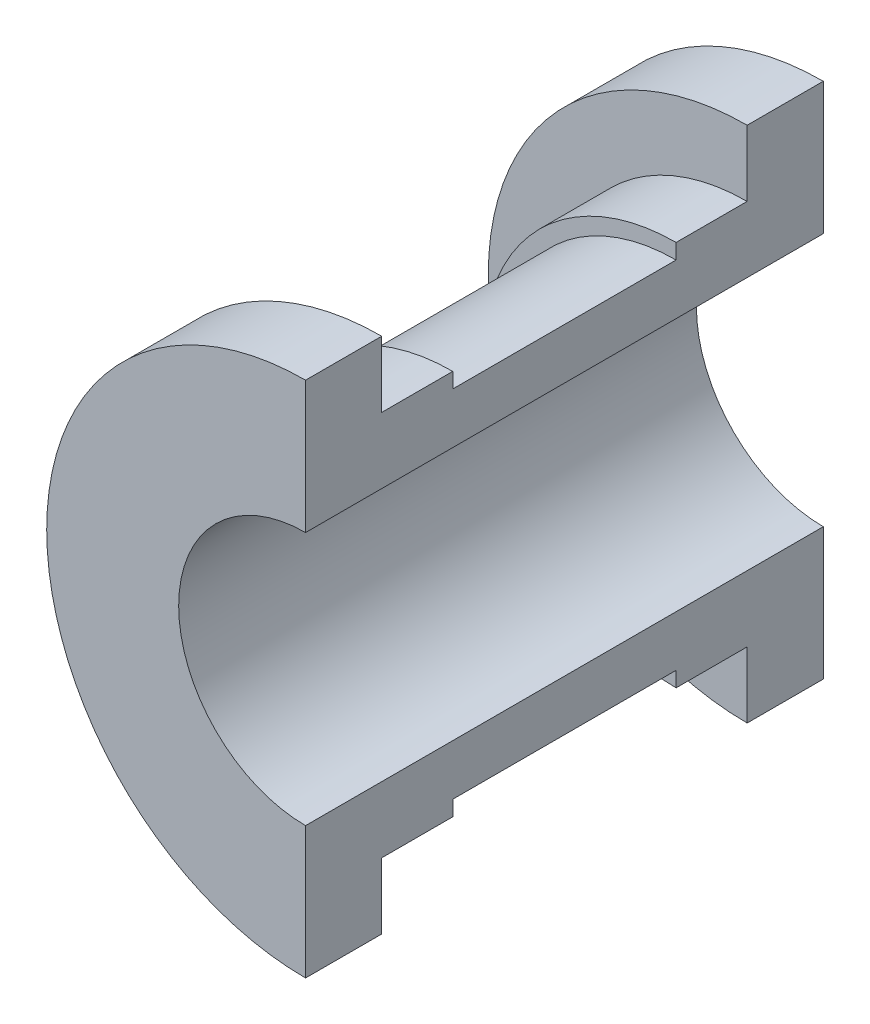
ISO-10303-21;
HEADER;
FILE_DESCRIPTION(('STEP AP214'),'2;1');
FILE_NAME('part.step','',(''),(''),'','','');
FILE_SCHEMA(('AUTOMOTIVE_DESIGN { 1 0 10303 214 1 1 1 1 }'));
ENDSEC;
DATA;
#1=APPLICATION_CONTEXT('core data for automotive mechanical design processes');
#2=APPLICATION_PROTOCOL_DEFINITION('international standard','automotive_design',2000,#1);
#3=PRODUCT_CONTEXT('',#1,'mechanical');
#4=PRODUCT('Part','Part','',(#3));
#5=PRODUCT_RELATED_PRODUCT_CATEGORY('part','',(#4));
#6=PRODUCT_DEFINITION_FORMATION('','',#4);
#7=PRODUCT_DEFINITION_CONTEXT('part definition',#1,'design');
#8=PRODUCT_DEFINITION('design','',#6,#7);
#9=PRODUCT_DEFINITION_SHAPE('','',#8);
#10=(LENGTH_UNIT() NAMED_UNIT(*) SI_UNIT(.MILLI.,.METRE.));
#11=(NAMED_UNIT(*) PLANE_ANGLE_UNIT() SI_UNIT($,.RADIAN.));
#12=(NAMED_UNIT(*) SI_UNIT($,.STERADIAN.) SOLID_ANGLE_UNIT());
#13=UNCERTAINTY_MEASURE_WITH_UNIT(LENGTH_MEASURE(1.E-05),#10,'distance_accuracy_value','');
#14=(GEOMETRIC_REPRESENTATION_CONTEXT(3) GLOBAL_UNCERTAINTY_ASSIGNED_CONTEXT((#13)) GLOBAL_UNIT_ASSIGNED_CONTEXT((#10,
#11,#12)) REPRESENTATION_CONTEXT('',''));
#15=CARTESIAN_POINT('',(0.,0.,0.));
#16=DIRECTION('',(0.,0.,1.));
#17=DIRECTION('',(1.,0.,0.));
#18=AXIS2_PLACEMENT_3D('',#15,#16,#17);
#19=CARTESIAN_POINT('',(-23.5,0.,25.5));
#20=DIRECTION('',(1.,0.,0.));
#21=DIRECTION('',(0.,0.,-1.));
#22=AXIS2_PLACEMENT_3D('',#19,#20,#21);
#23=CYLINDRICAL_SURFACE('',#22,3.);
#24=CARTESIAN_POINT('',(-23.5,0.,25.5));
#25=DIRECTION('',(1.,0.,0.));
#26=DIRECTION('',(0.,0.,-1.));
#27=AXIS2_PLACEMENT_3D('',#24,#25,#26);
#28=CIRCLE('',#27,3.);
#29=CARTESIAN_POINT('',(-23.5,0.,22.5));
#30=VERTEX_POINT('',#29);
#31=EDGE_CURVE('E11',#30,#30,#28,.T.);
#32=ORIENTED_EDGE('',*,*,#31,.T.);
#33=EDGE_LOOP('',(#32));
#34=FACE_BOUND('',#33,.T.);
#35=CARTESIAN_POINT('',(-17.5,0.,25.5));
#36=DIRECTION('',(1.,0.,0.));
#37=DIRECTION('',(0.,0.,-1.));
#38=AXIS2_PLACEMENT_3D('',#35,#36,#37);
#39=CIRCLE('',#38,3.);
#40=CARTESIAN_POINT('',(-17.5,0.,22.5));
#41=VERTEX_POINT('',#40);
#42=EDGE_CURVE('E43',#41,#41,#39,.T.);
#43=ORIENTED_EDGE('',*,*,#42,.F.);
#44=EDGE_LOOP('',(#43));
#45=FACE_BOUND('',#44,.T.);
#46=ADVANCED_FACE('F40',(#34,#45),#23,.T.);
#47=CARTESIAN_POINT('',(-23.5,0.,25.5));
#48=DIRECTION('',(1.,0.,0.));
#49=DIRECTION('',(0.,0.,-1.));
#50=AXIS2_PLACEMENT_3D('',#47,#48,#49);
#51=PLANE('',#50);
#52=ORIENTED_EDGE('',*,*,#31,.F.);
#53=EDGE_LOOP('',(#52));
#54=FACE_BOUND('',#53,.T.);
#55=ADVANCED_FACE('F55',(#54),#51,.F.);
#56=CARTESIAN_POINT('',(-17.5,0.,25.5));
#57=DIRECTION('',(1.,0.,0.));
#58=DIRECTION('',(0.,0.,-1.));
#59=AXIS2_PLACEMENT_3D('',#56,#57,#58);
#60=PLANE('',#59);
#61=ORIENTED_EDGE('',*,*,#42,.T.);
#62=EDGE_LOOP('',(#61));
#63=FACE_BOUND('',#62,.T.);
#64=ADVANCED_FACE('F52',(#63),#60,.T.);
#65=CLOSED_SHELL('',(#46,#55,#64));
#66=MANIFOLD_SOLID_BREP('B2',#65);
#67=CARTESIAN_POINT('',(0.,-25.5,0.));
#68=DIRECTION('',(0.,0.,-1.));
#69=DIRECTION('',(-1.,0.,0.));
#70=AXIS2_PLACEMENT_3D('',#67,#68,#69);
#71=PLANE('',#70);
#72=CARTESIAN_POINT('',(0.,0.,0.));
#73=DIRECTION('',(0.,0.,-1.));
#74=DIRECTION('',(-1.,0.,0.));
#75=AXIS2_PLACEMENT_3D('',#72,#73,#74);
#76=CIRCLE('',#75,12.5);
#77=CARTESIAN_POINT('',(0.,-12.5,0.));
#78=VERTEX_POINT('',#77);
#79=CARTESIAN_POINT('',(0.,12.5,0.));
#80=VERTEX_POINT('',#79);
#81=EDGE_CURVE('E38',#78,#80,#76,.T.);
#82=ORIENTED_EDGE('',*,*,#81,.F.);
#83=DIRECTION('',(0.,-1.,0.));
#84=VECTOR('',#83,1.);
#85=CARTESIAN_POINT('',(0.,-25.5,0.));
#86=LINE('',#85,#84);
#87=CARTESIAN_POINT('',(0.,-25.5,0.));
#88=VERTEX_POINT('',#87);
#89=EDGE_CURVE('E169',#78,#88,#86,.T.);
#90=ORIENTED_EDGE('',*,*,#89,.T.);
#91=CARTESIAN_POINT('',(0.,0.,0.));
#92=DIRECTION('',(0.,0.,-1.));
#93=DIRECTION('',(-1.,0.,0.));
#94=AXIS2_PLACEMENT_3D('',#91,#92,#93);
#95=CIRCLE('',#94,25.5);
#96=CARTESIAN_POINT('',(0.,25.5,0.));
#97=VERTEX_POINT('',#96);
#98=EDGE_CURVE('E164',#88,#97,#95,.T.);
#99=ORIENTED_EDGE('',*,*,#98,.T.);
#100=DIRECTION('',(0.,1.,0.));
#101=VECTOR('',#100,1.);
#102=CARTESIAN_POINT('',(0.,25.5,0.));
#103=LINE('',#102,#101);
#104=EDGE_CURVE('E167',#80,#97,#103,.T.);
#105=ORIENTED_EDGE('',*,*,#104,.F.);
#106=EDGE_LOOP('',(#82,#90,#99,#105));
#107=FACE_BOUND('',#106,.T.);
#108=ADVANCED_FACE('F80',(#107),#71,.T.);
#109=CARTESIAN_POINT('',(0.,0.,-45.6568957060864));
#110=DIRECTION('',(0.,0.,-1.));
#111=DIRECTION('',(-1.,0.,0.));
#112=AXIS2_PLACEMENT_3D('',#109,#110,#111);
#113=CYLINDRICAL_SURFACE('',#112,12.5);
#114=CARTESIAN_POINT('',(0.,0.,51.));
#115=DIRECTION('',(0.,0.,-1.));
#116=DIRECTION('',(-1.,0.,0.));
#117=AXIS2_PLACEMENT_3D('',#114,#115,#116);
#118=CIRCLE('',#117,12.5);
#119=CARTESIAN_POINT('',(0.,-12.5,51.));
#120=VERTEX_POINT('',#119);
#121=CARTESIAN_POINT('',(0.,12.5,51.));
#122=VERTEX_POINT('',#121);
#123=EDGE_CURVE('E88',#120,#122,#118,.T.);
#124=ORIENTED_EDGE('',*,*,#123,.F.);
#125=DIRECTION('',(0.,0.,-1.));
#126=VECTOR('',#125,1.);
#127=CARTESIAN_POINT('',(0.,-12.5,0.));
#128=LINE('',#127,#126);
#129=EDGE_CURVE('E174',#120,#78,#128,.T.);
#130=ORIENTED_EDGE('',*,*,#129,.T.);
#131=ORIENTED_EDGE('',*,*,#81,.T.);
#132=DIRECTION('',(0.,0.,-1.));
#133=VECTOR('',#132,1.);
#134=CARTESIAN_POINT('',(0.,12.5,0.));
#135=LINE('',#134,#133);
#136=EDGE_CURVE('E187',#122,#80,#135,.T.);
#137=ORIENTED_EDGE('',*,*,#136,.F.);
#138=EDGE_LOOP('',(#124,#130,#131,#137));
#139=FACE_BOUND('',#138,.T.);
#140=ADVANCED_FACE('F82',(#139),#113,.F.);
#141=CARTESIAN_POINT('',(0.,-12.5,51.));
#142=DIRECTION('',(0.,0.,1.));
#143=DIRECTION('',(1.,0.,0.));
#144=AXIS2_PLACEMENT_3D('',#141,#142,#143);
#145=PLANE('',#144);
#146=CARTESIAN_POINT('',(0.,0.,51.));
#147=DIRECTION('',(0.,0.,-1.));
#148=DIRECTION('',(-1.,0.,0.));
#149=AXIS2_PLACEMENT_3D('',#146,#147,#148);
#150=CIRCLE('',#149,25.5);
#151=CARTESIAN_POINT('',(0.,-25.5,51.));
#152=VERTEX_POINT('',#151);
#153=CARTESIAN_POINT('',(0.,25.5,51.));
#154=VERTEX_POINT('',#153);
#155=EDGE_CURVE('E260',#152,#154,#150,.T.);
#156=ORIENTED_EDGE('',*,*,#155,.F.);
#157=DIRECTION('',(0.,1.,0.));
#158=VECTOR('',#157,1.);
#159=CARTESIAN_POINT('',(0.,-12.5,51.));
#160=LINE('',#159,#158);
#161=EDGE_CURVE('E242',#152,#120,#160,.T.);
#162=ORIENTED_EDGE('',*,*,#161,.T.);
#163=ORIENTED_EDGE('',*,*,#123,.T.);
#164=DIRECTION('',(0.,-1.,0.));
#165=VECTOR('',#164,1.);
#166=CARTESIAN_POINT('',(0.,12.5,51.));
#167=LINE('',#166,#165);
#168=EDGE_CURVE('E212',#154,#122,#167,.T.);
#169=ORIENTED_EDGE('',*,*,#168,.F.);
#170=EDGE_LOOP('',(#156,#162,#163,#169));
#171=FACE_BOUND('',#170,.T.);
#172=ADVANCED_FACE('F263',(#171),#145,.T.);
#173=CARTESIAN_POINT('',(0.,0.,-45.6568957060864));
#174=DIRECTION('',(0.,0.,-1.));
#175=DIRECTION('',(-1.,0.,0.));
#176=AXIS2_PLACEMENT_3D('',#173,#174,#175);
#177=CYLINDRICAL_SURFACE('',#176,25.5);
#178=CARTESIAN_POINT('',(0.,0.,43.5));
#179=DIRECTION('',(0.,0.,-1.));
#180=DIRECTION('',(-1.,0.,0.));
#181=AXIS2_PLACEMENT_3D('',#178,#179,#180);
#182=CIRCLE('',#181,25.5);
#183=CARTESIAN_POINT('',(0.,-25.5,43.5));
#184=VERTEX_POINT('',#183);
#185=CARTESIAN_POINT('',(0.,25.5,43.5));
#186=VERTEX_POINT('',#185);
#187=EDGE_CURVE('E258',#184,#186,#182,.T.);
#188=ORIENTED_EDGE('',*,*,#187,.F.);
#189=DIRECTION('',(0.,0.,1.));
#190=VECTOR('',#189,1.);
#191=CARTESIAN_POINT('',(0.,-25.5,51.));
#192=LINE('',#191,#190);
#193=EDGE_CURVE('E239',#184,#152,#192,.T.);
#194=ORIENTED_EDGE('',*,*,#193,.T.);
#195=ORIENTED_EDGE('',*,*,#155,.T.);
#196=DIRECTION('',(0.,0.,1.));
#197=VECTOR('',#196,1.);
#198=CARTESIAN_POINT('',(0.,25.5,51.));
#199=LINE('',#198,#197);
#200=EDGE_CURVE('E209',#186,#154,#199,.T.);
#201=ORIENTED_EDGE('',*,*,#200,.F.);
#202=EDGE_LOOP('',(#188,#194,#195,#201));
#203=FACE_BOUND('',#202,.T.);
#204=ADVANCED_FACE('F298',(#203),#177,.T.);
#205=CARTESIAN_POINT('',(0.,-25.5,43.5));
#206=DIRECTION('',(0.,0.,-1.));
#207=DIRECTION('',(-1.,0.,0.));
#208=AXIS2_PLACEMENT_3D('',#205,#206,#207);
#209=PLANE('',#208);
#210=CARTESIAN_POINT('',(0.,0.,43.5));
#211=DIRECTION('',(0.,0.,-1.));
#212=DIRECTION('',(-1.,0.,0.));
#213=AXIS2_PLACEMENT_3D('',#210,#211,#212);
#214=CIRCLE('',#213,19.);
#215=CARTESIAN_POINT('',(0.,-19.,43.5));
#216=VERTEX_POINT('',#215);
#217=CARTESIAN_POINT('',(0.,19.,43.5));
#218=VERTEX_POINT('',#217);
#219=EDGE_CURVE('E256',#216,#218,#214,.T.);
#220=ORIENTED_EDGE('',*,*,#219,.F.);
#221=DIRECTION('',(0.,-1.,0.));
#222=VECTOR('',#221,1.);
#223=CARTESIAN_POINT('',(0.,-25.5,43.5));
#224=LINE('',#223,#222);
#225=EDGE_CURVE('E236',#216,#184,#224,.T.);
#226=ORIENTED_EDGE('',*,*,#225,.T.);
#227=ORIENTED_EDGE('',*,*,#187,.T.);
#228=DIRECTION('',(0.,1.,0.));
#229=VECTOR('',#228,1.);
#230=CARTESIAN_POINT('',(0.,25.5,43.5));
#231=LINE('',#230,#229);
#232=EDGE_CURVE('E206',#218,#186,#231,.T.);
#233=ORIENTED_EDGE('',*,*,#232,.F.);
#234=EDGE_LOOP('',(#220,#226,#227,#233));
#235=FACE_BOUND('',#234,.T.);
#236=ADVANCED_FACE('F295',(#235),#209,.T.);
#237=CARTESIAN_POINT('',(0.,0.,-45.6568957060864));
#238=DIRECTION('',(0.,0.,-1.));
#239=DIRECTION('',(-1.,0.,0.));
#240=AXIS2_PLACEMENT_3D('',#237,#238,#239);
#241=CYLINDRICAL_SURFACE('',#240,19.);
#242=CARTESIAN_POINT('',(0.,0.,36.5));
#243=DIRECTION('',(0.,0.,-1.));
#244=DIRECTION('',(-1.,0.,0.));
#245=AXIS2_PLACEMENT_3D('',#242,#243,#244);
#246=CIRCLE('',#245,19.);
#247=CARTESIAN_POINT('',(0.,-19.,36.5));
#248=VERTEX_POINT('',#247);
#249=CARTESIAN_POINT('',(0.,19.,36.5));
#250=VERTEX_POINT('',#249);
#251=EDGE_CURVE('E254',#248,#250,#246,.T.);
#252=ORIENTED_EDGE('',*,*,#251,.F.);
#253=DIRECTION('',(0.,0.,1.));
#254=VECTOR('',#253,1.);
#255=CARTESIAN_POINT('',(0.,-19.,43.5));
#256=LINE('',#255,#254);
#257=EDGE_CURVE('E233',#248,#216,#256,.T.);
#258=ORIENTED_EDGE('',*,*,#257,.T.);
#259=ORIENTED_EDGE('',*,*,#219,.T.);
#260=DIRECTION('',(0.,0.,1.));
#261=VECTOR('',#260,1.);
#262=CARTESIAN_POINT('',(0.,19.,43.5));
#263=LINE('',#262,#261);
#264=EDGE_CURVE('E203',#250,#218,#263,.T.);
#265=ORIENTED_EDGE('',*,*,#264,.F.);
#266=EDGE_LOOP('',(#252,#258,#259,#265));
#267=FACE_BOUND('',#266,.T.);
#268=ADVANCED_FACE('F292',(#267),#241,.T.);
#269=CARTESIAN_POINT('',(0.,-19.,36.5));
#270=DIRECTION('',(0.,0.,-1.));
#271=DIRECTION('',(-1.,0.,0.));
#272=AXIS2_PLACEMENT_3D('',#269,#270,#271);
#273=PLANE('',#272);
#274=CARTESIAN_POINT('',(0.,0.,36.5));
#275=DIRECTION('',(0.,0.,-1.));
#276=DIRECTION('',(-1.,0.,0.));
#277=AXIS2_PLACEMENT_3D('',#274,#275,#276);
#278=CIRCLE('',#277,17.5);
#279=CARTESIAN_POINT('',(0.,-17.5,36.5));
#280=VERTEX_POINT('',#279);
#281=CARTESIAN_POINT('',(0.,17.5,36.5));
#282=VERTEX_POINT('',#281);
#283=EDGE_CURVE('E252',#280,#282,#278,.T.);
#284=ORIENTED_EDGE('',*,*,#283,.F.);
#285=DIRECTION('',(0.,-1.,0.));
#286=VECTOR('',#285,1.);
#287=CARTESIAN_POINT('',(0.,-19.,36.5));
#288=LINE('',#287,#286);
#289=EDGE_CURVE('E230',#280,#248,#288,.T.);
#290=ORIENTED_EDGE('',*,*,#289,.T.);
#291=ORIENTED_EDGE('',*,*,#251,.T.);
#292=DIRECTION('',(0.,1.,0.));
#293=VECTOR('',#292,1.);
#294=CARTESIAN_POINT('',(0.,19.,36.5));
#295=LINE('',#294,#293);
#296=EDGE_CURVE('E200',#282,#250,#295,.T.);
#297=ORIENTED_EDGE('',*,*,#296,.F.);
#298=EDGE_LOOP('',(#284,#290,#291,#297));
#299=FACE_BOUND('',#298,.T.);
#300=ADVANCED_FACE('F287',(#299),#273,.T.);
#301=CARTESIAN_POINT('',(0.,0.,-45.6568957060864));
#302=DIRECTION('',(0.,0.,-1.));
#303=DIRECTION('',(-1.,0.,0.));
#304=AXIS2_PLACEMENT_3D('',#301,#302,#303);
#305=CYLINDRICAL_SURFACE('',#304,17.5);
#306=CARTESIAN_POINT('',(0.,0.,14.5));
#307=DIRECTION('',(0.,0.,-1.));
#308=DIRECTION('',(-1.,0.,0.));
#309=AXIS2_PLACEMENT_3D('',#306,#307,#308);
#310=CIRCLE('',#309,17.5);
#311=CARTESIAN_POINT('',(0.,-17.5,14.5));
#312=VERTEX_POINT('',#311);
#313=CARTESIAN_POINT('',(0.,17.5,14.5));
#314=VERTEX_POINT('',#313);
#315=EDGE_CURVE('E250',#312,#314,#310,.T.);
#316=ORIENTED_EDGE('',*,*,#315,.F.);
#317=DIRECTION('',(0.,0.,1.));
#318=VECTOR('',#317,1.);
#319=CARTESIAN_POINT('',(0.,-17.5,36.5));
#320=LINE('',#319,#318);
#321=EDGE_CURVE('E227',#312,#280,#320,.T.);
#322=ORIENTED_EDGE('',*,*,#321,.T.);
#323=ORIENTED_EDGE('',*,*,#283,.T.);
#324=DIRECTION('',(0.,0.,1.));
#325=VECTOR('',#324,1.);
#326=CARTESIAN_POINT('',(0.,17.5,36.5));
#327=LINE('',#326,#325);
#328=EDGE_CURVE('E197',#314,#282,#327,.T.);
#329=ORIENTED_EDGE('',*,*,#328,.F.);
#330=EDGE_LOOP('',(#316,#322,#323,#329));
#331=FACE_BOUND('',#330,.T.);
#332=ADVANCED_FACE('F284',(#331),#305,.T.);
#333=CARTESIAN_POINT('',(0.,-17.5,14.5));
#334=DIRECTION('',(0.,0.,1.));
#335=DIRECTION('',(1.,0.,0.));
#336=AXIS2_PLACEMENT_3D('',#333,#334,#335);
#337=PLANE('',#336);
#338=CARTESIAN_POINT('',(0.,0.,14.5));
#339=DIRECTION('',(0.,0.,-1.));
#340=DIRECTION('',(-1.,0.,0.));
#341=AXIS2_PLACEMENT_3D('',#338,#339,#340);
#342=CIRCLE('',#341,19.);
#343=CARTESIAN_POINT('',(0.,-19.,14.5));
#344=VERTEX_POINT('',#343);
#345=CARTESIAN_POINT('',(0.,19.,14.5));
#346=VERTEX_POINT('',#345);
#347=EDGE_CURVE('E248',#344,#346,#342,.T.);
#348=ORIENTED_EDGE('',*,*,#347,.F.);
#349=DIRECTION('',(0.,1.,0.));
#350=VECTOR('',#349,1.);
#351=CARTESIAN_POINT('',(0.,-17.5,14.5));
#352=LINE('',#351,#350);
#353=EDGE_CURVE('E224',#344,#312,#352,.T.);
#354=ORIENTED_EDGE('',*,*,#353,.T.);
#355=ORIENTED_EDGE('',*,*,#315,.T.);
#356=DIRECTION('',(0.,-1.,0.));
#357=VECTOR('',#356,1.);
#358=CARTESIAN_POINT('',(0.,17.5,14.5));
#359=LINE('',#358,#357);
#360=EDGE_CURVE('E194',#346,#314,#359,.T.);
#361=ORIENTED_EDGE('',*,*,#360,.F.);
#362=EDGE_LOOP('',(#348,#354,#355,#361));
#363=FACE_BOUND('',#362,.T.);
#364=ADVANCED_FACE('F279',(#363),#337,.T.);
#365=CARTESIAN_POINT('',(0.,0.,-45.6568957060864));
#366=DIRECTION('',(0.,0.,-1.));
#367=DIRECTION('',(-1.,0.,0.));
#368=AXIS2_PLACEMENT_3D('',#365,#366,#367);
#369=CYLINDRICAL_SURFACE('',#368,19.);
#370=CARTESIAN_POINT('',(0.,0.,7.5));
#371=DIRECTION('',(0.,0.,-1.));
#372=DIRECTION('',(-1.,0.,0.));
#373=AXIS2_PLACEMENT_3D('',#370,#371,#372);
#374=CIRCLE('',#373,19.);
#375=CARTESIAN_POINT('',(0.,-19.,7.5));
#376=VERTEX_POINT('',#375);
#377=CARTESIAN_POINT('',(0.,19.,7.5));
#378=VERTEX_POINT('',#377);
#379=EDGE_CURVE('E246',#376,#378,#374,.T.);
#380=ORIENTED_EDGE('',*,*,#379,.F.);
#381=DIRECTION('',(0.,0.,1.));
#382=VECTOR('',#381,1.);
#383=CARTESIAN_POINT('',(0.,-19.,14.5));
#384=LINE('',#383,#382);
#385=EDGE_CURVE('E221',#376,#344,#384,.T.);
#386=ORIENTED_EDGE('',*,*,#385,.T.);
#387=ORIENTED_EDGE('',*,*,#347,.T.);
#388=DIRECTION('',(0.,0.,1.));
#389=VECTOR('',#388,1.);
#390=CARTESIAN_POINT('',(0.,19.,14.5));
#391=LINE('',#390,#389);
#392=EDGE_CURVE('E191',#378,#346,#391,.T.);
#393=ORIENTED_EDGE('',*,*,#392,.F.);
#394=EDGE_LOOP('',(#380,#386,#387,#393));
#395=FACE_BOUND('',#394,.T.);
#396=ADVANCED_FACE('F277',(#395),#369,.T.);
#397=CARTESIAN_POINT('',(0.,-19.,7.5));
#398=DIRECTION('',(0.,0.,1.));
#399=DIRECTION('',(1.,0.,0.));
#400=AXIS2_PLACEMENT_3D('',#397,#398,#399);
#401=PLANE('',#400);
#402=CARTESIAN_POINT('',(0.,0.,7.5));
#403=DIRECTION('',(0.,0.,-1.));
#404=DIRECTION('',(-1.,0.,0.));
#405=AXIS2_PLACEMENT_3D('',#402,#403,#404);
#406=CIRCLE('',#405,25.5);
#407=CARTESIAN_POINT('',(0.,-25.5,7.5));
#408=VERTEX_POINT('',#407);
#409=CARTESIAN_POINT('',(0.,25.5,7.5));
#410=VERTEX_POINT('',#409);
#411=EDGE_CURVE('E173',#408,#410,#406,.T.);
#412=ORIENTED_EDGE('',*,*,#411,.F.);
#413=DIRECTION('',(0.,1.,0.));
#414=VECTOR('',#413,1.);
#415=CARTESIAN_POINT('',(0.,-19.,7.5));
#416=LINE('',#415,#414);
#417=EDGE_CURVE('E218',#408,#376,#416,.T.);
#418=ORIENTED_EDGE('',*,*,#417,.T.);
#419=ORIENTED_EDGE('',*,*,#379,.T.);
#420=DIRECTION('',(0.,-1.,0.));
#421=VECTOR('',#420,1.);
#422=CARTESIAN_POINT('',(0.,19.,7.5));
#423=LINE('',#422,#421);
#424=EDGE_CURVE('E182',#410,#378,#423,.T.);
#425=ORIENTED_EDGE('',*,*,#424,.F.);
#426=EDGE_LOOP('',(#412,#418,#419,#425));
#427=FACE_BOUND('',#426,.T.);
#428=ADVANCED_FACE('F273',(#427),#401,.T.);
#429=CARTESIAN_POINT('',(0.,0.,-45.6568957060864));
#430=DIRECTION('',(0.,0.,-1.));
#431=DIRECTION('',(-1.,0.,0.));
#432=AXIS2_PLACEMENT_3D('',#429,#430,#431);
#433=CYLINDRICAL_SURFACE('',#432,25.5);
#434=DIRECTION('',(0.,0.,1.));
#435=VECTOR('',#434,1.);
#436=CARTESIAN_POINT('',(0.,-25.5,7.5));
#437=LINE('',#436,#435);
#438=EDGE_CURVE('E216',#88,#408,#437,.T.);
#439=ORIENTED_EDGE('',*,*,#438,.T.);
#440=ORIENTED_EDGE('',*,*,#411,.T.);
#441=DIRECTION('',(0.,0.,1.));
#442=VECTOR('',#441,1.);
#443=CARTESIAN_POINT('',(0.,25.5,7.5));
#444=LINE('',#443,#442);
#445=EDGE_CURVE('E177',#97,#410,#444,.T.);
#446=ORIENTED_EDGE('',*,*,#445,.F.);
#447=ORIENTED_EDGE('',*,*,#98,.F.);
#448=EDGE_LOOP('',(#439,#440,#446,#447));
#449=FACE_BOUND('',#448,.T.);
#450=ADVANCED_FACE('F178',(#449),#433,.T.);
#451=CARTESIAN_POINT('',(0.,0.,0.));
#452=DIRECTION('',(1.,0.,0.));
#453=DIRECTION('',(0.,0.,-1.));
#454=AXIS2_PLACEMENT_3D('',#451,#452,#453);
#455=PLANE('',#454);
#456=ORIENTED_EDGE('',*,*,#89,.F.);
#457=ORIENTED_EDGE('',*,*,#129,.F.);
#458=ORIENTED_EDGE('',*,*,#161,.F.);
#459=ORIENTED_EDGE('',*,*,#193,.F.);
#460=ORIENTED_EDGE('',*,*,#225,.F.);
#461=ORIENTED_EDGE('',*,*,#257,.F.);
#462=ORIENTED_EDGE('',*,*,#289,.F.);
#463=ORIENTED_EDGE('',*,*,#321,.F.);
#464=ORIENTED_EDGE('',*,*,#353,.F.);
#465=ORIENTED_EDGE('',*,*,#385,.F.);
#466=ORIENTED_EDGE('',*,*,#417,.F.);
#467=ORIENTED_EDGE('',*,*,#438,.F.);
#468=EDGE_LOOP('',(#456,#457,#458,#459,#460,#461,#462,#463,#464,#465,#466,#467));
#469=FACE_BOUND('',#468,.T.);
#470=ADVANCED_FACE('F268',(#469),#455,.T.);
#471=CARTESIAN_POINT('',(0.,0.,0.));
#472=DIRECTION('',(-1.,0.,0.));
#473=DIRECTION('',(0.,0.,-1.));
#474=AXIS2_PLACEMENT_3D('',#471,#472,#473);
#475=PLANE('',#474);
#476=ORIENTED_EDGE('',*,*,#104,.T.);
#477=ORIENTED_EDGE('',*,*,#445,.T.);
#478=ORIENTED_EDGE('',*,*,#424,.T.);
#479=ORIENTED_EDGE('',*,*,#392,.T.);
#480=ORIENTED_EDGE('',*,*,#360,.T.);
#481=ORIENTED_EDGE('',*,*,#328,.T.);
#482=ORIENTED_EDGE('',*,*,#296,.T.);
#483=ORIENTED_EDGE('',*,*,#264,.T.);
#484=ORIENTED_EDGE('',*,*,#232,.T.);
#485=ORIENTED_EDGE('',*,*,#200,.T.);
#486=ORIENTED_EDGE('',*,*,#168,.T.);
#487=ORIENTED_EDGE('',*,*,#136,.T.);
#488=EDGE_LOOP('',(#476,#477,#478,#479,#480,#481,#482,#483,#484,#485,#486,#487));
#489=FACE_BOUND('',#488,.T.);
#490=ADVANCED_FACE('F185',(#489),#475,.F.);
#491=CLOSED_SHELL('',(#108,#140,#172,#204,#236,#268,#300,#332,#364,#396,#428,#450,#470,#490));
#492=MANIFOLD_SOLID_BREP('B6',#491);
#493=ADVANCED_BREP_SHAPE_REPRESENTATION('',(#18,#66,#492),#14);
#494=SHAPE_DEFINITION_REPRESENTATION(#9,#493);
ENDSEC;
END-ISO-10303-21;
